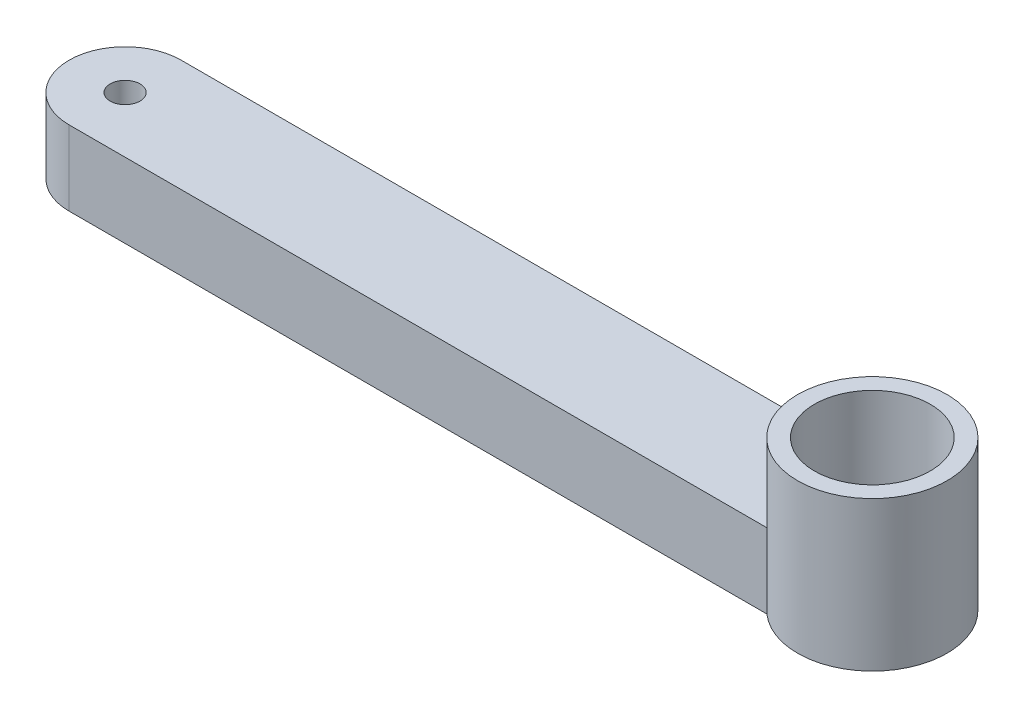
ISO-10303-21;
HEADER;
FILE_DESCRIPTION(('STEP AP214'),'2;1');
FILE_NAME('part.step','',(''),(''),'','','');
FILE_SCHEMA(('AUTOMOTIVE_DESIGN { 1 0 10303 214 1 1 1 1 }'));
ENDSEC;
DATA;
#1=APPLICATION_CONTEXT('core data for automotive mechanical design processes');
#2=APPLICATION_PROTOCOL_DEFINITION('international standard','automotive_design',2000,#1);
#3=PRODUCT_CONTEXT('',#1,'mechanical');
#4=PRODUCT('Part','Part','',(#3));
#5=PRODUCT_RELATED_PRODUCT_CATEGORY('part','',(#4));
#6=PRODUCT_DEFINITION_FORMATION('','',#4);
#7=PRODUCT_DEFINITION_CONTEXT('part definition',#1,'design');
#8=PRODUCT_DEFINITION('design','',#6,#7);
#9=PRODUCT_DEFINITION_SHAPE('','',#8);
#10=(LENGTH_UNIT() NAMED_UNIT(*) SI_UNIT(.MILLI.,.METRE.));
#11=(NAMED_UNIT(*) PLANE_ANGLE_UNIT() SI_UNIT($,.RADIAN.));
#12=(NAMED_UNIT(*) SI_UNIT($,.STERADIAN.) SOLID_ANGLE_UNIT());
#13=UNCERTAINTY_MEASURE_WITH_UNIT(LENGTH_MEASURE(1.E-05),#10,'distance_accuracy_value','');
#14=(GEOMETRIC_REPRESENTATION_CONTEXT(3) GLOBAL_UNCERTAINTY_ASSIGNED_CONTEXT((#13)) GLOBAL_UNIT_ASSIGNED_CONTEXT((#10,
#11,#12)) REPRESENTATION_CONTEXT('',''));
#15=CARTESIAN_POINT('',(0.,0.,0.));
#16=DIRECTION('',(0.,0.,1.));
#17=DIRECTION('',(1.,0.,0.));
#18=AXIS2_PLACEMENT_3D('',#15,#16,#17);
#19=CARTESIAN_POINT('',(0.,10.,7.5));
#20=DIRECTION('',(0.,0.,-1.));
#21=DIRECTION('',(-1.,0.,0.));
#22=AXIS2_PLACEMENT_3D('',#19,#20,#21);
#23=PLANE('',#22);
#24=DIRECTION('',(0.,-1.,0.));
#25=VECTOR('',#24,1.);
#26=CARTESIAN_POINT('',(93.3856217223385,20.,7.5));
#27=LINE('',#26,#25);
#28=CARTESIAN_POINT('',(93.3856217223385,10.,7.5));
#29=VERTEX_POINT('',#28);
#30=CARTESIAN_POINT('',(93.3856217223385,0.,7.5));
#31=VERTEX_POINT('',#30);
#32=EDGE_CURVE('E55',#29,#31,#27,.T.);
#33=ORIENTED_EDGE('',*,*,#32,.F.);
#34=DIRECTION('',(1.,0.,0.));
#35=VECTOR('',#34,1.);
#36=CARTESIAN_POINT('',(0.,10.,7.5));
#37=LINE('',#36,#35);
#38=CARTESIAN_POINT('',(0.,10.,7.5));
#39=VERTEX_POINT('',#38);
#40=EDGE_CURVE('E127',#39,#29,#37,.T.);
#41=ORIENTED_EDGE('',*,*,#40,.F.);
#42=DIRECTION('',(0.,-1.,0.));
#43=VECTOR('',#42,1.);
#44=CARTESIAN_POINT('',(0.,10.,7.5));
#45=LINE('',#44,#43);
#46=CARTESIAN_POINT('',(0.,0.,7.5));
#47=VERTEX_POINT('',#46);
#48=EDGE_CURVE('E48',#39,#47,#45,.T.);
#49=ORIENTED_EDGE('',*,*,#48,.T.);
#50=DIRECTION('',(1.,0.,0.));
#51=VECTOR('',#50,1.);
#52=CARTESIAN_POINT('',(0.,0.,7.5));
#53=LINE('',#52,#51);
#54=EDGE_CURVE('E60',#47,#31,#53,.T.);
#55=ORIENTED_EDGE('',*,*,#54,.T.);
#56=EDGE_LOOP('',(#33,#41,#49,#55));
#57=FACE_BOUND('',#56,.T.);
#58=ADVANCED_FACE('F39',(#57),#23,.F.);
#59=CARTESIAN_POINT('',(0.,10.,-7.5));
#60=DIRECTION('',(0.,0.,1.));
#61=DIRECTION('',(1.,0.,0.));
#62=AXIS2_PLACEMENT_3D('',#59,#60,#61);
#63=PLANE('',#62);
#64=DIRECTION('',(0.,-1.,0.));
#65=VECTOR('',#64,1.);
#66=CARTESIAN_POINT('',(93.3856217223385,20.,-7.5));
#67=LINE('',#66,#65);
#68=CARTESIAN_POINT('',(93.3856217223385,0.,-7.5));
#69=VERTEX_POINT('',#68);
#70=CARTESIAN_POINT('',(93.3856217223385,10.,-7.5));
#71=VERTEX_POINT('',#70);
#72=EDGE_CURVE('E11',#69,#71,#67,.F.);
#73=ORIENTED_EDGE('',*,*,#72,.F.);
#74=DIRECTION('',(-1.,0.,0.));
#75=VECTOR('',#74,1.);
#76=CARTESIAN_POINT('',(0.,0.,-7.5));
#77=LINE('',#76,#75);
#78=CARTESIAN_POINT('',(0.,0.,-7.5));
#79=VERTEX_POINT('',#78);
#80=EDGE_CURVE('E79',#69,#79,#77,.T.);
#81=ORIENTED_EDGE('',*,*,#80,.T.);
#82=DIRECTION('',(0.,-1.,0.));
#83=VECTOR('',#82,1.);
#84=CARTESIAN_POINT('',(0.,10.,-7.5));
#85=LINE('',#84,#83);
#86=CARTESIAN_POINT('',(0.,10.,-7.5));
#87=VERTEX_POINT('',#86);
#88=EDGE_CURVE('E132',#87,#79,#85,.T.);
#89=ORIENTED_EDGE('',*,*,#88,.F.);
#90=DIRECTION('',(-1.,0.,0.));
#91=VECTOR('',#90,1.);
#92=CARTESIAN_POINT('',(0.,10.,-7.5));
#93=LINE('',#92,#91);
#94=EDGE_CURVE('E95',#71,#87,#93,.T.);
#95=ORIENTED_EDGE('',*,*,#94,.F.);
#96=EDGE_LOOP('',(#73,#81,#89,#95));
#97=FACE_BOUND('',#96,.T.);
#98=ADVANCED_FACE('F94',(#97),#63,.F.);
#99=CARTESIAN_POINT('',(0.,10.,0.));
#100=DIRECTION('',(0.,1.,0.));
#101=DIRECTION('',(0.,0.,1.));
#102=AXIS2_PLACEMENT_3D('',#99,#100,#101);
#103=PLANE('',#102);
#104=CARTESIAN_POINT('',(0.,10.,0.));
#105=DIRECTION('',(0.,1.,0.));
#106=DIRECTION('',(0.,0.,1.));
#107=AXIS2_PLACEMENT_3D('',#104,#105,#106);
#108=CIRCLE('',#107,2.);
#109=CARTESIAN_POINT('',(0.,10.,2.));
#110=VERTEX_POINT('',#109);
#111=EDGE_CURVE('E117',#110,#110,#108,.T.);
#112=ORIENTED_EDGE('',*,*,#111,.F.);
#113=EDGE_LOOP('',(#112));
#114=FACE_BOUND('',#113,.T.);
#115=ORIENTED_EDGE('',*,*,#40,.T.);
#116=CARTESIAN_POINT('',(100.,10.,0.));
#117=DIRECTION('',(0.,1.,0.));
#118=DIRECTION('',(0.,0.,1.));
#119=AXIS2_PLACEMENT_3D('',#116,#117,#118);
#120=CIRCLE('',#119,9.99999999999999);
#121=EDGE_CURVE('E106',#29,#71,#120,.F.);
#122=ORIENTED_EDGE('',*,*,#121,.T.);
#123=ORIENTED_EDGE('',*,*,#94,.T.);
#124=CARTESIAN_POINT('',(0.,10.,0.));
#125=DIRECTION('',(0.,1.,0.));
#126=DIRECTION('',(0.,0.,1.));
#127=AXIS2_PLACEMENT_3D('',#124,#125,#126);
#128=CIRCLE('',#127,7.5);
#129=EDGE_CURVE('E91',#87,#39,#128,.T.);
#130=ORIENTED_EDGE('',*,*,#129,.T.);
#131=EDGE_LOOP('',(#115,#122,#123,#130));
#132=FACE_BOUND('',#131,.T.);
#133=ADVANCED_FACE('F143',(#114,#132),#103,.T.);
#134=CARTESIAN_POINT('',(0.,0.,0.));
#135=DIRECTION('',(0.,1.,0.));
#136=DIRECTION('',(0.,0.,1.));
#137=AXIS2_PLACEMENT_3D('',#134,#135,#136);
#138=PLANE('',#137);
#139=CARTESIAN_POINT('',(100.,0.,0.));
#140=DIRECTION('',(0.,1.,0.));
#141=DIRECTION('',(0.,0.,1.));
#142=AXIS2_PLACEMENT_3D('',#139,#140,#141);
#143=CIRCLE('',#142,7.75000000000001);
#144=CARTESIAN_POINT('',(100.,0.,7.75000000000001));
#145=VERTEX_POINT('',#144);
#146=EDGE_CURVE('E101',#145,#145,#143,.F.);
#147=ORIENTED_EDGE('',*,*,#146,.F.);
#148=EDGE_LOOP('',(#147));
#149=FACE_BOUND('',#148,.T.);
#150=ORIENTED_EDGE('',*,*,#80,.F.);
#151=CARTESIAN_POINT('',(100.,0.,0.));
#152=DIRECTION('',(0.,1.,0.));
#153=DIRECTION('',(0.,0.,1.));
#154=AXIS2_PLACEMENT_3D('',#151,#152,#153);
#155=CIRCLE('',#154,9.99999999999999);
#156=EDGE_CURVE('E84',#31,#69,#155,.T.);
#157=ORIENTED_EDGE('',*,*,#156,.F.);
#158=ORIENTED_EDGE('',*,*,#54,.F.);
#159=CARTESIAN_POINT('',(0.,0.,0.));
#160=DIRECTION('',(0.,1.,0.));
#161=DIRECTION('',(0.,0.,1.));
#162=AXIS2_PLACEMENT_3D('',#159,#160,#161);
#163=CIRCLE('',#162,7.5);
#164=EDGE_CURVE('E86',#79,#47,#163,.T.);
#165=ORIENTED_EDGE('',*,*,#164,.F.);
#166=EDGE_LOOP('',(#150,#157,#158,#165));
#167=FACE_BOUND('',#166,.T.);
#168=CARTESIAN_POINT('',(0.,0.,0.));
#169=DIRECTION('',(0.,1.,0.));
#170=DIRECTION('',(0.,0.,1.));
#171=AXIS2_PLACEMENT_3D('',#168,#169,#170);
#172=CIRCLE('',#171,2.);
#173=CARTESIAN_POINT('',(0.,0.,2.));
#174=VERTEX_POINT('',#173);
#175=EDGE_CURVE('E116',#174,#174,#172,.T.);
#176=ORIENTED_EDGE('',*,*,#175,.T.);
#177=EDGE_LOOP('',(#176));
#178=FACE_BOUND('',#177,.T.);
#179=ADVANCED_FACE('F81',(#149,#167,#178),#138,.F.);
#180=CARTESIAN_POINT('',(0.,10.,0.));
#181=DIRECTION('',(0.,-1.,0.));
#182=DIRECTION('',(0.,0.,-1.));
#183=AXIS2_PLACEMENT_3D('',#180,#181,#182);
#184=CYLINDRICAL_SURFACE('',#183,7.5);
#185=ORIENTED_EDGE('',*,*,#164,.T.);
#186=ORIENTED_EDGE('',*,*,#48,.F.);
#187=ORIENTED_EDGE('',*,*,#129,.F.);
#188=ORIENTED_EDGE('',*,*,#88,.T.);
#189=EDGE_LOOP('',(#185,#186,#187,#188));
#190=FACE_BOUND('',#189,.T.);
#191=ADVANCED_FACE('F41',(#190),#184,.T.);
#192=CARTESIAN_POINT('',(0.,10.,0.));
#193=DIRECTION('',(0.,-1.,0.));
#194=DIRECTION('',(0.,0.,-1.));
#195=AXIS2_PLACEMENT_3D('',#192,#193,#194);
#196=CYLINDRICAL_SURFACE('',#195,2.);
#197=ORIENTED_EDGE('',*,*,#111,.T.);
#198=EDGE_LOOP('',(#197));
#199=FACE_BOUND('',#198,.T.);
#200=ORIENTED_EDGE('',*,*,#175,.F.);
#201=EDGE_LOOP('',(#200));
#202=FACE_BOUND('',#201,.T.);
#203=ADVANCED_FACE('F180',(#199,#202),#196,.F.);
#204=CARTESIAN_POINT('',(100.,20.,0.));
#205=DIRECTION('',(0.,-1.,0.));
#206=DIRECTION('',(0.,0.,-1.));
#207=AXIS2_PLACEMENT_3D('',#204,#205,#206);
#208=CYLINDRICAL_SURFACE('',#207,9.99999999999999);
#209=CARTESIAN_POINT('',(100.,20.,0.));
#210=DIRECTION('',(0.,1.,0.));
#211=DIRECTION('',(0.,0.,1.));
#212=AXIS2_PLACEMENT_3D('',#209,#210,#211);
#213=CIRCLE('',#212,9.99999999999999);
#214=CARTESIAN_POINT('',(100.,20.,9.99999999999999));
#215=VERTEX_POINT('',#214);
#216=EDGE_CURVE('E100',#215,#215,#213,.T.);
#217=ORIENTED_EDGE('',*,*,#216,.F.);
#218=EDGE_LOOP('',(#217));
#219=FACE_BOUND('',#218,.T.);
#220=ORIENTED_EDGE('',*,*,#121,.F.);
#221=ORIENTED_EDGE('',*,*,#32,.T.);
#222=ORIENTED_EDGE('',*,*,#156,.T.);
#223=ORIENTED_EDGE('',*,*,#72,.T.);
#224=EDGE_LOOP('',(#220,#221,#222,#223));
#225=FACE_BOUND('',#224,.T.);
#226=ADVANCED_FACE('F98',(#219,#225),#208,.T.);
#227=CARTESIAN_POINT('',(100.,20.,0.));
#228=DIRECTION('',(0.,1.,0.));
#229=DIRECTION('',(0.,0.,1.));
#230=AXIS2_PLACEMENT_3D('',#227,#228,#229);
#231=PLANE('',#230);
#232=CARTESIAN_POINT('',(100.,20.,0.));
#233=DIRECTION('',(0.,1.,0.));
#234=DIRECTION('',(0.,0.,1.));
#235=AXIS2_PLACEMENT_3D('',#232,#233,#234);
#236=CIRCLE('',#235,7.75000000000001);
#237=CARTESIAN_POINT('',(100.,20.,7.75000000000001));
#238=VERTEX_POINT('',#237);
#239=EDGE_CURVE('E109',#238,#238,#236,.T.);
#240=ORIENTED_EDGE('',*,*,#239,.F.);
#241=EDGE_LOOP('',(#240));
#242=FACE_BOUND('',#241,.T.);
#243=ORIENTED_EDGE('',*,*,#216,.T.);
#244=EDGE_LOOP('',(#243));
#245=FACE_BOUND('',#244,.T.);
#246=ADVANCED_FACE('F179',(#242,#245),#231,.T.);
#247=CARTESIAN_POINT('',(100.,-0.001000000000001,0.));
#248=DIRECTION('',(0.,1.,0.));
#249=DIRECTION('',(0.,0.,1.));
#250=AXIS2_PLACEMENT_3D('',#247,#248,#249);
#251=CYLINDRICAL_SURFACE('',#250,7.75000000000001);
#252=ORIENTED_EDGE('',*,*,#239,.T.);
#253=EDGE_LOOP('',(#252));
#254=FACE_BOUND('',#253,.T.);
#255=ORIENTED_EDGE('',*,*,#146,.T.);
#256=EDGE_LOOP('',(#255));
#257=FACE_BOUND('',#256,.T.);
#258=ADVANCED_FACE('F198',(#254,#257),#251,.F.);
#259=CLOSED_SHELL('',(#58,#98,#133,#179,#191,#203,#226,#246,#258));
#260=MANIFOLD_SOLID_BREP('B2',#259);
#261=ADVANCED_BREP_SHAPE_REPRESENTATION('',(#18,#260),#14);
#262=SHAPE_DEFINITION_REPRESENTATION(#9,#261);
ENDSEC;
END-ISO-10303-21;
